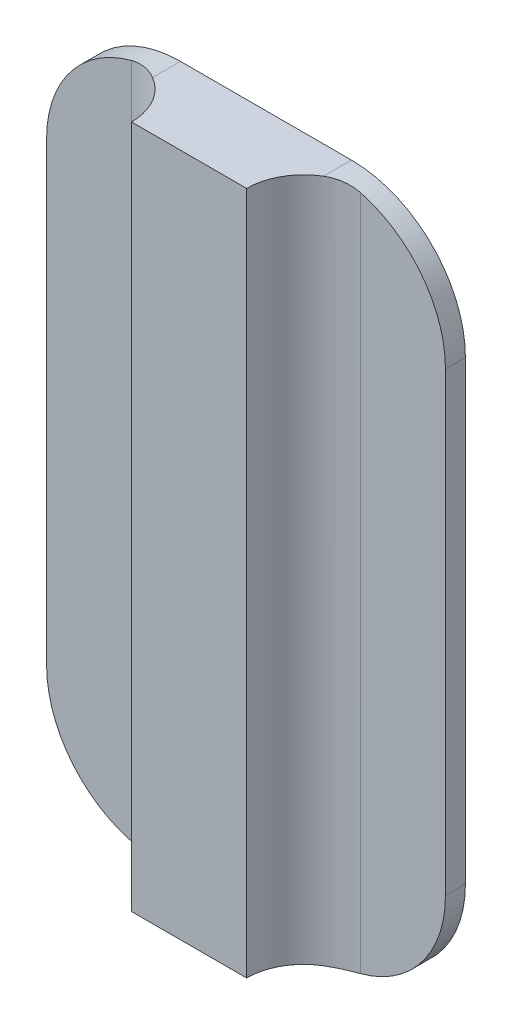
ISO-10303-21;
HEADER;
FILE_DESCRIPTION(('STEP AP214'),'2;1');
FILE_NAME('part.step','',(''),(''),'','','');
FILE_SCHEMA(('AUTOMOTIVE_DESIGN { 1 0 10303 214 1 1 1 1 }'));
ENDSEC;
DATA;
#1=APPLICATION_CONTEXT('core data for automotive mechanical design processes');
#2=APPLICATION_PROTOCOL_DEFINITION('international standard','automotive_design',2000,#1);
#3=PRODUCT_CONTEXT('',#1,'mechanical');
#4=PRODUCT('Part','Part','',(#3));
#5=PRODUCT_RELATED_PRODUCT_CATEGORY('part','',(#4));
#6=PRODUCT_DEFINITION_FORMATION('','',#4);
#7=PRODUCT_DEFINITION_CONTEXT('part definition',#1,'design');
#8=PRODUCT_DEFINITION('design','',#6,#7);
#9=PRODUCT_DEFINITION_SHAPE('','',#8);
#10=(LENGTH_UNIT() NAMED_UNIT(*) SI_UNIT(.MILLI.,.METRE.));
#11=(NAMED_UNIT(*) PLANE_ANGLE_UNIT() SI_UNIT($,.RADIAN.));
#12=(NAMED_UNIT(*) SI_UNIT($,.STERADIAN.) SOLID_ANGLE_UNIT());
#13=UNCERTAINTY_MEASURE_WITH_UNIT(LENGTH_MEASURE(1.E-05),#10,'distance_accuracy_value','');
#14=(GEOMETRIC_REPRESENTATION_CONTEXT(3) GLOBAL_UNCERTAINTY_ASSIGNED_CONTEXT((#13)) GLOBAL_UNIT_ASSIGNED_CONTEXT((#10,
#11,#12)) REPRESENTATION_CONTEXT('',''));
#15=CARTESIAN_POINT('',(0.,0.,0.));
#16=DIRECTION('',(0.,0.,1.));
#17=DIRECTION('',(1.,0.,0.));
#18=AXIS2_PLACEMENT_3D('',#15,#16,#17);
#19=CARTESIAN_POINT('',(0.,0.,3.5));
#20=DIRECTION('',(0.,0.,-1.));
#21=DIRECTION('',(-1.,0.,0.));
#22=AXIS2_PLACEMENT_3D('',#19,#20,#21);
#23=PLANE('',#22);
#24=DIRECTION('',(0.,1.,0.));
#25=VECTOR('',#24,1.);
#26=CARTESIAN_POINT('',(55.1,0.,3.5));
#27=LINE('',#26,#25);
#28=CARTESIAN_POINT('',(55.1,119.33882106024,3.5));
#29=VERTEX_POINT('',#28);
#30=CARTESIAN_POINT('',(55.1,0.661178939759539,3.5));
#31=VERTEX_POINT('',#30);
#32=EDGE_CURVE('E172',#29,#31,#27,.F.);
#33=ORIENTED_EDGE('',*,*,#32,.T.);
#34=CARTESIAN_POINT('',(50.,20.,3.5));
#35=DIRECTION('',(0.,0.,-1.));
#36=DIRECTION('',(-1.,0.,0.));
#37=AXIS2_PLACEMENT_3D('',#34,#35,#36);
#38=CIRCLE('',#37,20.);
#39=CARTESIAN_POINT('',(70.,20.,3.5));
#40=VERTEX_POINT('',#39);
#41=EDGE_CURVE('E253',#31,#40,#38,.F.);
#42=ORIENTED_EDGE('',*,*,#41,.T.);
#43=DIRECTION('',(0.,1.,0.));
#44=VECTOR('',#43,1.);
#45=CARTESIAN_POINT('',(70.,0.,3.5));
#46=LINE('',#45,#44);
#47=CARTESIAN_POINT('',(70.,100.,3.5));
#48=VERTEX_POINT('',#47);
#49=EDGE_CURVE('E157',#40,#48,#46,.T.);
#50=ORIENTED_EDGE('',*,*,#49,.T.);
#51=CARTESIAN_POINT('',(50.,100.,3.5));
#52=DIRECTION('',(0.,0.,-1.));
#53=DIRECTION('',(-1.,0.,0.));
#54=AXIS2_PLACEMENT_3D('',#51,#52,#53);
#55=CIRCLE('',#54,20.);
#56=EDGE_CURVE('E257',#48,#29,#55,.F.);
#57=ORIENTED_EDGE('',*,*,#56,.T.);
#58=EDGE_LOOP('',(#33,#42,#50,#57));
#59=FACE_BOUND('',#58,.T.);
#60=ADVANCED_FACE('F33',(#59),#23,.F.);
#61=DIRECTION('',(0.,-1.,0.));
#62=VECTOR('',#61,1.);
#63=CARTESIAN_POINT('',(0.,0.,3.5));
#64=LINE('',#63,#62);
#65=CARTESIAN_POINT('',(0.,100.,3.5));
#66=VERTEX_POINT('',#65);
#67=CARTESIAN_POINT('',(0.,20.,3.5));
#68=VERTEX_POINT('',#67);
#69=EDGE_CURVE('E154',#66,#68,#64,.T.);
#70=ORIENTED_EDGE('',*,*,#69,.T.);
#71=CARTESIAN_POINT('',(20.,20.,3.5));
#72=DIRECTION('',(0.,0.,-1.));
#73=DIRECTION('',(-1.,0.,0.));
#74=AXIS2_PLACEMENT_3D('',#71,#72,#73);
#75=CIRCLE('',#74,20.);
#76=CARTESIAN_POINT('',(14.9,0.661178939759543,3.5));
#77=VERTEX_POINT('',#76);
#78=EDGE_CURVE('E260',#68,#77,#75,.F.);
#79=ORIENTED_EDGE('',*,*,#78,.T.);
#80=DIRECTION('',(0.,-1.,0.));
#81=VECTOR('',#80,1.);
#82=CARTESIAN_POINT('',(14.9,120.,3.5));
#83=LINE('',#82,#81);
#84=CARTESIAN_POINT('',(14.9,119.33882106024,3.5));
#85=VERTEX_POINT('',#84);
#86=EDGE_CURVE('E161',#77,#85,#83,.F.);
#87=ORIENTED_EDGE('',*,*,#86,.T.);
#88=CARTESIAN_POINT('',(20.,100.,3.5));
#89=DIRECTION('',(0.,0.,-1.));
#90=DIRECTION('',(-1.,0.,0.));
#91=AXIS2_PLACEMENT_3D('',#88,#89,#90);
#92=CIRCLE('',#91,20.);
#93=EDGE_CURVE('E255',#85,#66,#92,.F.);
#94=ORIENTED_EDGE('',*,*,#93,.T.);
#95=EDGE_LOOP('',(#70,#79,#87,#94));
#96=FACE_BOUND('',#95,.T.);
#97=ADVANCED_FACE('F263',(#96),#23,.F.);
#98=CARTESIAN_POINT('',(0.,0.,3.5));
#99=DIRECTION('',(1.,0.,0.));
#100=DIRECTION('',(0.,0.,-1.));
#101=AXIS2_PLACEMENT_3D('',#98,#99,#100);
#102=PLANE('',#101);
#103=DIRECTION('',(0.,-1.,0.));
#104=VECTOR('',#103,1.);
#105=CARTESIAN_POINT('',(0.,0.,0.));
#106=LINE('',#105,#104);
#107=CARTESIAN_POINT('',(0.,100.,0.));
#108=VERTEX_POINT('',#107);
#109=CARTESIAN_POINT('',(0.,20.,0.));
#110=VERTEX_POINT('',#109);
#111=EDGE_CURVE('E153',#108,#110,#106,.T.);
#112=ORIENTED_EDGE('',*,*,#111,.T.);
#113=DIRECTION('',(0.,0.,-1.));
#114=VECTOR('',#113,1.);
#115=CARTESIAN_POINT('',(0.,20.,3.5));
#116=LINE('',#115,#114);
#117=EDGE_CURVE('E252',#110,#68,#116,.F.);
#118=ORIENTED_EDGE('',*,*,#117,.T.);
#119=ORIENTED_EDGE('',*,*,#69,.F.);
#120=DIRECTION('',(0.,0.,-1.));
#121=VECTOR('',#120,1.);
#122=CARTESIAN_POINT('',(0.,100.,3.5));
#123=LINE('',#122,#121);
#124=EDGE_CURVE('E247',#66,#108,#123,.T.);
#125=ORIENTED_EDGE('',*,*,#124,.T.);
#126=EDGE_LOOP('',(#112,#118,#119,#125));
#127=FACE_BOUND('',#126,.T.);
#128=ADVANCED_FACE('F250',(#127),#102,.F.);
#129=CARTESIAN_POINT('',(0.,0.,3.5));
#130=DIRECTION('',(0.,1.,0.));
#131=DIRECTION('',(0.,0.,1.));
#132=AXIS2_PLACEMENT_3D('',#129,#130,#131);
#133=PLANE('',#132);
#134=DIRECTION('',(1.,0.,0.));
#135=VECTOR('',#134,1.);
#136=CARTESIAN_POINT('',(0.,0.,0.));
#137=LINE('',#136,#135);
#138=CARTESIAN_POINT('',(20.,0.,0.));
#139=VERTEX_POINT('',#138);
#140=CARTESIAN_POINT('',(50.,0.,0.));
#141=VERTEX_POINT('',#140);
#142=EDGE_CURVE('E164',#139,#141,#137,.T.);
#143=ORIENTED_EDGE('',*,*,#142,.T.);
#144=DIRECTION('',(0.,0.,-1.));
#145=VECTOR('',#144,1.);
#146=CARTESIAN_POINT('',(50.,0.,3.5));
#147=LINE('',#146,#145);
#148=CARTESIAN_POINT('',(50.,0.,4.89825599078884));
#149=VERTEX_POINT('',#148);
#150=EDGE_CURVE('E196',#141,#149,#147,.F.);
#151=ORIENTED_EDGE('',*,*,#150,.T.);
#152=CARTESIAN_POINT('',(55.1,0.,13.5));
#153=DIRECTION('',(0.,1.,0.));
#154=DIRECTION('',(0.,0.,1.));
#155=AXIS2_PLACEMENT_3D('',#152,#153,#154);
#156=CIRCLE('',#155,10.);
#157=CARTESIAN_POINT('',(45.1,0.,13.5));
#158=VERTEX_POINT('',#157);
#159=EDGE_CURVE('E134',#149,#158,#156,.T.);
#160=ORIENTED_EDGE('',*,*,#159,.T.);
#161=DIRECTION('',(1.,0.,0.));
#162=VECTOR('',#161,1.);
#163=CARTESIAN_POINT('',(24.9,0.,13.5));
#164=LINE('',#163,#162);
#165=CARTESIAN_POINT('',(24.9,0.,13.5));
#166=VERTEX_POINT('',#165);
#167=EDGE_CURVE('E148',#166,#158,#164,.T.);
#168=ORIENTED_EDGE('',*,*,#167,.F.);
#169=CARTESIAN_POINT('',(14.9,0.,13.5));
#170=DIRECTION('',(0.,1.,0.));
#171=DIRECTION('',(0.,0.,1.));
#172=AXIS2_PLACEMENT_3D('',#169,#170,#171);
#173=CIRCLE('',#172,10.);
#174=CARTESIAN_POINT('',(20.,0.,4.89825599078884));
#175=VERTEX_POINT('',#174);
#176=EDGE_CURVE('E175',#166,#175,#173,.T.);
#177=ORIENTED_EDGE('',*,*,#176,.T.);
#178=DIRECTION('',(0.,0.,-1.));
#179=VECTOR('',#178,1.);
#180=CARTESIAN_POINT('',(20.,0.,3.5));
#181=LINE('',#180,#179);
#182=EDGE_CURVE('E193',#175,#139,#181,.T.);
#183=ORIENTED_EDGE('',*,*,#182,.T.);
#184=EDGE_LOOP('',(#143,#151,#160,#168,#177,#183));
#185=FACE_BOUND('',#184,.T.);
#186=ADVANCED_FACE('F268',(#185),#133,.F.);
#187=CARTESIAN_POINT('',(70.,0.,3.5));
#188=DIRECTION('',(-1.,0.,0.));
#189=DIRECTION('',(0.,0.,1.));
#190=AXIS2_PLACEMENT_3D('',#187,#188,#189);
#191=PLANE('',#190);
#192=ORIENTED_EDGE('',*,*,#49,.F.);
#193=DIRECTION('',(0.,0.,-1.));
#194=VECTOR('',#193,1.);
#195=CARTESIAN_POINT('',(70.,20.,3.5));
#196=LINE('',#195,#194);
#197=CARTESIAN_POINT('',(70.,20.,0.));
#198=VERTEX_POINT('',#197);
#199=EDGE_CURVE('E182',#40,#198,#196,.T.);
#200=ORIENTED_EDGE('',*,*,#199,.T.);
#201=DIRECTION('',(0.,1.,0.));
#202=VECTOR('',#201,1.);
#203=CARTESIAN_POINT('',(70.,0.,0.));
#204=LINE('',#203,#202);
#205=CARTESIAN_POINT('',(70.,100.,0.));
#206=VERTEX_POINT('',#205);
#207=EDGE_CURVE('E167',#198,#206,#204,.T.);
#208=ORIENTED_EDGE('',*,*,#207,.T.);
#209=DIRECTION('',(0.,0.,-1.));
#210=VECTOR('',#209,1.);
#211=CARTESIAN_POINT('',(70.,100.,3.5));
#212=LINE('',#211,#210);
#213=EDGE_CURVE('E180',#206,#48,#212,.F.);
#214=ORIENTED_EDGE('',*,*,#213,.T.);
#215=EDGE_LOOP('',(#192,#200,#208,#214));
#216=FACE_BOUND('',#215,.T.);
#217=ADVANCED_FACE('F275',(#216),#191,.F.);
#218=CARTESIAN_POINT('',(0.,120.,3.5));
#219=DIRECTION('',(0.,-1.,0.));
#220=DIRECTION('',(0.,0.,-1.));
#221=AXIS2_PLACEMENT_3D('',#218,#219,#220);
#222=PLANE('',#221);
#223=DIRECTION('',(-1.,0.,0.));
#224=VECTOR('',#223,1.);
#225=CARTESIAN_POINT('',(0.,120.,0.));
#226=LINE('',#225,#224);
#227=CARTESIAN_POINT('',(50.,120.,0.));
#228=VERTEX_POINT('',#227);
#229=CARTESIAN_POINT('',(20.,120.,0.));
#230=VERTEX_POINT('',#229);
#231=EDGE_CURVE('E158',#228,#230,#226,.T.);
#232=ORIENTED_EDGE('',*,*,#231,.T.);
#233=DIRECTION('',(0.,0.,-1.));
#234=VECTOR('',#233,1.);
#235=CARTESIAN_POINT('',(20.,120.,3.5));
#236=LINE('',#235,#234);
#237=CARTESIAN_POINT('',(20.,120.,4.89825599078884));
#238=VERTEX_POINT('',#237);
#239=EDGE_CURVE('E11',#230,#238,#236,.F.);
#240=ORIENTED_EDGE('',*,*,#239,.T.);
#241=CARTESIAN_POINT('',(14.9,120.,13.5));
#242=DIRECTION('',(0.,-1.,0.));
#243=DIRECTION('',(0.,0.,-1.));
#244=AXIS2_PLACEMENT_3D('',#241,#242,#243);
#245=CIRCLE('',#244,10.);
#246=CARTESIAN_POINT('',(24.9,120.,13.5));
#247=VERTEX_POINT('',#246);
#248=EDGE_CURVE('E135',#238,#247,#245,.T.);
#249=ORIENTED_EDGE('',*,*,#248,.T.);
#250=DIRECTION('',(-1.,0.,0.));
#251=VECTOR('',#250,1.);
#252=CARTESIAN_POINT('',(24.9,120.,13.5));
#253=LINE('',#252,#251);
#254=CARTESIAN_POINT('',(45.1,120.,13.5));
#255=VERTEX_POINT('',#254);
#256=EDGE_CURVE('E138',#255,#247,#253,.T.);
#257=ORIENTED_EDGE('',*,*,#256,.F.);
#258=CARTESIAN_POINT('',(55.1,120.,13.5));
#259=DIRECTION('',(0.,-1.,0.));
#260=DIRECTION('',(0.,0.,-1.));
#261=AXIS2_PLACEMENT_3D('',#258,#259,#260);
#262=CIRCLE('',#261,10.);
#263=CARTESIAN_POINT('',(50.,120.,4.89825599078884));
#264=VERTEX_POINT('',#263);
#265=EDGE_CURVE('E123',#255,#264,#262,.T.);
#266=ORIENTED_EDGE('',*,*,#265,.T.);
#267=DIRECTION('',(0.,0.,-1.));
#268=VECTOR('',#267,1.);
#269=CARTESIAN_POINT('',(50.,120.,3.5));
#270=LINE('',#269,#268);
#271=EDGE_CURVE('E42',#264,#228,#270,.T.);
#272=ORIENTED_EDGE('',*,*,#271,.T.);
#273=EDGE_LOOP('',(#232,#240,#249,#257,#266,#272));
#274=FACE_BOUND('',#273,.T.);
#275=ADVANCED_FACE('F139',(#274),#222,.F.);
#276=CARTESIAN_POINT('',(0.,0.,0.));
#277=DIRECTION('',(0.,0.,-1.));
#278=DIRECTION('',(-1.,0.,0.));
#279=AXIS2_PLACEMENT_3D('',#276,#277,#278);
#280=PLANE('',#279);
#281=ORIENTED_EDGE('',*,*,#207,.F.);
#282=CARTESIAN_POINT('',(50.,20.,0.));
#283=DIRECTION('',(0.,0.,-1.));
#284=DIRECTION('',(-1.,0.,0.));
#285=AXIS2_PLACEMENT_3D('',#282,#283,#284);
#286=CIRCLE('',#285,20.);
#287=EDGE_CURVE('E191',#198,#141,#286,.T.);
#288=ORIENTED_EDGE('',*,*,#287,.T.);
#289=ORIENTED_EDGE('',*,*,#142,.F.);
#290=CARTESIAN_POINT('',(20.,20.,0.));
#291=DIRECTION('',(0.,0.,-1.));
#292=DIRECTION('',(-1.,0.,0.));
#293=AXIS2_PLACEMENT_3D('',#290,#291,#292);
#294=CIRCLE('',#293,20.);
#295=EDGE_CURVE('E189',#139,#110,#294,.T.);
#296=ORIENTED_EDGE('',*,*,#295,.T.);
#297=ORIENTED_EDGE('',*,*,#111,.F.);
#298=CARTESIAN_POINT('',(20.,100.,0.));
#299=DIRECTION('',(0.,0.,-1.));
#300=DIRECTION('',(-1.,0.,0.));
#301=AXIS2_PLACEMENT_3D('',#298,#299,#300);
#302=CIRCLE('',#301,20.);
#303=EDGE_CURVE('E187',#108,#230,#302,.T.);
#304=ORIENTED_EDGE('',*,*,#303,.T.);
#305=ORIENTED_EDGE('',*,*,#231,.F.);
#306=CARTESIAN_POINT('',(50.,100.,0.));
#307=DIRECTION('',(0.,0.,-1.));
#308=DIRECTION('',(-1.,0.,0.));
#309=AXIS2_PLACEMENT_3D('',#306,#307,#308);
#310=CIRCLE('',#309,20.);
#311=EDGE_CURVE('E185',#228,#206,#310,.T.);
#312=ORIENTED_EDGE('',*,*,#311,.T.);
#313=EDGE_LOOP('',(#281,#288,#289,#296,#297,#304,#305,#312));
#314=FACE_BOUND('',#313,.T.);
#315=ADVANCED_FACE('F241',(#314),#280,.T.);
#316=CARTESIAN_POINT('',(0.,0.,13.5));
#317=DIRECTION('',(0.,0.,-1.));
#318=DIRECTION('',(-1.,0.,0.));
#319=AXIS2_PLACEMENT_3D('',#316,#317,#318);
#320=PLANE('',#319);
#321=DIRECTION('',(0.,1.,0.));
#322=VECTOR('',#321,1.);
#323=CARTESIAN_POINT('',(45.1,0.,13.5));
#324=LINE('',#323,#322);
#325=EDGE_CURVE('E128',#158,#255,#324,.T.);
#326=ORIENTED_EDGE('',*,*,#325,.T.);
#327=ORIENTED_EDGE('',*,*,#256,.T.);
#328=DIRECTION('',(0.,-1.,0.));
#329=VECTOR('',#328,1.);
#330=CARTESIAN_POINT('',(24.9,0.,13.5));
#331=LINE('',#330,#329);
#332=EDGE_CURVE('E143',#247,#166,#331,.T.);
#333=ORIENTED_EDGE('',*,*,#332,.T.);
#334=ORIENTED_EDGE('',*,*,#167,.T.);
#335=EDGE_LOOP('',(#326,#327,#333,#334));
#336=FACE_BOUND('',#335,.T.);
#337=ADVANCED_FACE('F146',(#336),#320,.F.);
#338=CARTESIAN_POINT('',(14.9,0.,13.5));
#339=DIRECTION('',(0.,1.,0.));
#340=DIRECTION('',(0.,0.,1.));
#341=AXIS2_PLACEMENT_3D('',#338,#339,#340);
#342=CYLINDRICAL_SURFACE('',#341,10.);
#343=ORIENTED_EDGE('',*,*,#86,.F.);
#344=CARTESIAN_POINT('',(14.9,0.661178939759543,3.5));
#345=CARTESIAN_POINT('',(15.0263243389157,0.62786360597415,3.49999971499555));
#346=CARTESIAN_POINT('',(15.1529618876326,0.595792572432518,3.50239425478418));
#347=CARTESIAN_POINT('',(15.4066712976193,0.534174312033795,3.51203701614571));
#348=CARTESIAN_POINT('',(15.533743178789,0.504627202471961,3.51928546315782));
#349=CARTESIAN_POINT('',(15.9153103327047,0.419827743324308,3.54840784025306));
#350=CARTESIAN_POINT('',(16.1701512771768,0.368418801675542,3.57765881230422));
#351=CARTESIAN_POINT('',(16.672393767317,0.277154811077839,3.65512191718378));
#352=CARTESIAN_POINT('',(16.9198247751712,0.237047846191173,3.70285261217251));
#353=CARTESIAN_POINT('',(17.4116304825512,0.166644238382593,3.8172625505769));
#354=CARTESIAN_POINT('',(17.6560061159343,0.136344523790127,3.88393584878333));
#355=CARTESIAN_POINT('',(18.0790044377199,0.0916354563151093,4.01685750809141));
#356=CARTESIAN_POINT('',(18.2587139381788,0.0751462855579517,4.07899970808425));
#357=CARTESIAN_POINT('',(18.6146384910868,0.0472400073845082,4.21357702167284));
#358=CARTESIAN_POINT('',(18.790853705579,0.0358226642403644,4.28601165669132));
#359=CARTESIAN_POINT('',(19.1423219889805,0.0176099328104667,4.44238563764497));
#360=CARTESIAN_POINT('',(19.3174949877549,0.0109052729401183,4.52651532357388));
#361=CARTESIAN_POINT('',(19.6627482453818,0.00209563798823149,4.70488500770233));
#362=CARTESIAN_POINT('',(19.8328282268674,-9.08702750478019E-06,4.79912555526548));
#363=CARTESIAN_POINT('',(20.,0.,4.89825599078884));
#364=B_SPLINE_CURVE_WITH_KNOTS('',3,(#344,#345,#346,#347,#348,#349,#350,#351,#352,#353,#354,
#355,#356,#357,#358,#359,#360,#361,#362,#363),.UNSPECIFIED.,.F.,.F.,(4,2,2,2,2,2,2,2,2,4),(0.,
0.391872308313273,0.783762818357363,1.56756189408804,2.33218358525991,3.09656556156022,
3.66880252934522,4.24101289797859,4.82395819937643,5.40693519058366),.UNSPECIFIED.);
#365=EDGE_CURVE('E228',#77,#175,#364,.T.);
#366=ORIENTED_EDGE('',*,*,#365,.T.);
#367=ORIENTED_EDGE('',*,*,#176,.F.);
#368=ORIENTED_EDGE('',*,*,#332,.F.);
#369=ORIENTED_EDGE('',*,*,#248,.F.);
#370=CARTESIAN_POINT('',(20.,120.,4.89825599078884));
#371=CARTESIAN_POINT('',(19.7752908458507,120.000032485777,4.764976706905));
#372=CARTESIAN_POINT('',(19.5452943068351,119.996214553252,4.64056038807037));
#373=CARTESIAN_POINT('',(19.0764613325542,119.980033924759,4.41016031385645));
#374=CARTESIAN_POINT('',(18.8376224880704,119.967668883543,4.30418162758454));
#375=CARTESIAN_POINT('',(18.3588980899787,119.933966847278,4.11379692819074));
#376=CARTESIAN_POINT('',(18.119181329185,119.912856925975,4.02892627406615));
#377=CARTESIAN_POINT('',(17.6349771478721,119.86116512115,3.8779336788484));
#378=CARTESIAN_POINT('',(17.3904912684179,119.830586251374,3.81180578518069));
#379=CARTESIAN_POINT('',(16.9604539922492,119.768555853484,3.71275060871731));
#380=CARTESIAN_POINT('',(16.7755368816389,119.739255957107,3.67565610368762));
#381=CARTESIAN_POINT('',(16.4048407182431,119.67511642557,3.61208762558375));
#382=CARTESIAN_POINT('',(16.2190617065302,119.640277051804,3.58561315158267));
#383=CARTESIAN_POINT('',(15.8439361205159,119.564365630893,3.54282795920231));
#384=CARTESIAN_POINT('',(15.6545880063808,119.523188912815,3.52671724670253));
#385=CARTESIAN_POINT('',(15.2765801664056,119.435202857162,3.50529691166317));
#386=CARTESIAN_POINT('',(15.0879204721083,119.388393264751,3.49998777799191));
#387=CARTESIAN_POINT('',(14.9,119.33882106024,3.5));
#388=B_SPLINE_CURVE_WITH_KNOTS('',3,(#370,#371,#372,#373,#374,#375,#376,#377,#378,#379,#380,
#381,#382,#383,#384,#385,#386,#387),.UNSPECIFIED.,.F.,.F.,(4,2,2,2,2,2,2,2,4),(0.,
0.783597740519574,1.567410578361,2.33203319718667,3.09641270420965,3.66864597857249,
4.24085225859312,4.82379397265962,5.40676206947923),.UNSPECIFIED.);
#389=EDGE_CURVE('E54',#238,#85,#388,.T.);
#390=ORIENTED_EDGE('',*,*,#389,.T.);
#391=EDGE_LOOP('',(#343,#366,#367,#368,#369,#390));
#392=FACE_BOUND('',#391,.T.);
#393=ADVANCED_FACE('F213',(#392),#342,.F.);
#394=CARTESIAN_POINT('',(55.1,0.,13.5));
#395=DIRECTION('',(0.,-1.,0.));
#396=DIRECTION('',(0.,0.,-1.));
#397=AXIS2_PLACEMENT_3D('',#394,#395,#396);
#398=CYLINDRICAL_SURFACE('',#397,10.);
#399=ORIENTED_EDGE('',*,*,#159,.F.);
#400=CARTESIAN_POINT('',(50.,0.,4.89825599078884));
#401=CARTESIAN_POINT('',(50.2247091541493,-3.24857766658174E-05,4.76497670690501));
#402=CARTESIAN_POINT('',(50.4547056931649,0.00378544674807885,4.64056038807037));
#403=CARTESIAN_POINT('',(50.9235386674458,0.0199660752413991,4.41016031385645));
#404=CARTESIAN_POINT('',(51.1623775119296,0.0323311164570464,4.30418162758454));
#405=CARTESIAN_POINT('',(51.6411019100213,0.0660331527216585,4.11379692819074));
#406=CARTESIAN_POINT('',(51.880818670815,0.0871430740254352,4.02892627406615));
#407=CARTESIAN_POINT('',(52.3650228521279,0.138834878850109,3.8779336788484));
#408=CARTESIAN_POINT('',(52.6095087315821,0.169413748626062,3.81180578518069));
#409=CARTESIAN_POINT('',(53.0395460077508,0.231444146516116,3.71275060871731));
#410=CARTESIAN_POINT('',(53.2244631183611,0.260744042892704,3.67565610368762));
#411=CARTESIAN_POINT('',(53.5951592817569,0.324883574430286,3.61208762558375));
#412=CARTESIAN_POINT('',(53.7809382934698,0.359722948196282,3.58561315158268));
#413=CARTESIAN_POINT('',(54.1560638794842,0.435634369106702,3.54282795920231));
#414=CARTESIAN_POINT('',(54.3454119936192,0.476811087185119,3.52671724670253));
#415=CARTESIAN_POINT('',(54.7234198335944,0.564797142838071,3.50529691166317));
#416=CARTESIAN_POINT('',(54.9120795278917,0.611606735249135,3.4999877779919));
#417=CARTESIAN_POINT('',(55.1,0.661178939759535,3.5));
#418=B_SPLINE_CURVE_WITH_KNOTS('',3,(#400,#401,#402,#403,#404,#405,#406,#407,#408,#409,#410,
#411,#412,#413,#414,#415,#416,#417),.UNSPECIFIED.,.F.,.F.,(4,2,2,2,2,2,2,2,4),(0.,
0.783597740519563,1.567410578361,2.33203319718667,3.09641270420965,3.6686459785725,
4.24085225859313,4.82379397265963,5.40676206947923),.UNSPECIFIED.);
#419=EDGE_CURVE('E203',#149,#31,#418,.T.);
#420=ORIENTED_EDGE('',*,*,#419,.T.);
#421=ORIENTED_EDGE('',*,*,#32,.F.);
#422=CARTESIAN_POINT('',(55.1,119.33882106024,3.5));
#423=CARTESIAN_POINT('',(54.9736756610843,119.372136394026,3.49999971499555));
#424=CARTESIAN_POINT('',(54.8470381123674,119.404207427567,3.50239425478418));
#425=CARTESIAN_POINT('',(54.5933287023807,119.465825687966,3.51203701614571));
#426=CARTESIAN_POINT('',(54.466256821211,119.495372797528,3.51928546315782));
#427=CARTESIAN_POINT('',(54.0846896672953,119.580172256676,3.54840784025306));
#428=CARTESIAN_POINT('',(53.8298487228232,119.631581198324,3.57765881230422));
#429=CARTESIAN_POINT('',(53.327606232683,119.722845188922,3.65512191718378));
#430=CARTESIAN_POINT('',(53.0801752248288,119.762952153809,3.70285261217252));
#431=CARTESIAN_POINT('',(52.5883695174488,119.833355761617,3.81726255057691));
#432=CARTESIAN_POINT('',(52.3439938840657,119.86365547621,3.88393584878333));
#433=CARTESIAN_POINT('',(51.9209955622802,119.908364543685,4.01685750809141));
#434=CARTESIAN_POINT('',(51.7412860618212,119.924853714442,4.07899970808425));
#435=CARTESIAN_POINT('',(51.3853615089133,119.952759992615,4.21357702167283));
#436=CARTESIAN_POINT('',(51.209146294421,119.96417733576,4.28601165669132));
#437=CARTESIAN_POINT('',(50.8576780110195,119.98239006719,4.44238563764497));
#438=CARTESIAN_POINT('',(50.6825050122451,119.98909472706,4.52651532357388));
#439=CARTESIAN_POINT('',(50.3372517546182,119.997904362012,4.70488500770232));
#440=CARTESIAN_POINT('',(50.1671717731326,120.000009087027,4.79912555526548));
#441=CARTESIAN_POINT('',(50.,120.,4.89825599078884));
#442=B_SPLINE_CURVE_WITH_KNOTS('',3,(#422,#423,#424,#425,#426,#427,#428,#429,#430,#431,#432,
#433,#434,#435,#436,#437,#438,#439,#440,#441),.UNSPECIFIED.,.F.,.F.,(4,2,2,2,2,2,2,2,2,4),(0.,
0.391872308313277,0.783762818357355,1.56756189408803,2.33218358525992,3.09656556156022,
3.66880252934521,4.24101289797858,4.82395819937643,5.40693519058367),.UNSPECIFIED.);
#443=EDGE_CURVE('E131',#29,#264,#442,.T.);
#444=ORIENTED_EDGE('',*,*,#443,.T.);
#445=ORIENTED_EDGE('',*,*,#265,.F.);
#446=ORIENTED_EDGE('',*,*,#325,.F.);
#447=EDGE_LOOP('',(#399,#420,#421,#444,#445,#446));
#448=FACE_BOUND('',#447,.T.);
#449=ADVANCED_FACE('F126',(#448),#398,.F.);
#450=CARTESIAN_POINT('',(50.,20.,3.5));
#451=DIRECTION('',(0.,0.,-1.));
#452=DIRECTION('',(-1.,0.,0.));
#453=AXIS2_PLACEMENT_3D('',#450,#451,#452);
#454=CYLINDRICAL_SURFACE('',#453,20.);
#455=ORIENTED_EDGE('',*,*,#419,.F.);
#456=ORIENTED_EDGE('',*,*,#150,.F.);
#457=ORIENTED_EDGE('',*,*,#287,.F.);
#458=ORIENTED_EDGE('',*,*,#199,.F.);
#459=ORIENTED_EDGE('',*,*,#41,.F.);
#460=EDGE_LOOP('',(#455,#456,#457,#458,#459));
#461=FACE_BOUND('',#460,.T.);
#462=ADVANCED_FACE('F212',(#461),#454,.T.);
#463=CARTESIAN_POINT('',(20.,20.,3.5));
#464=DIRECTION('',(0.,0.,-1.));
#465=DIRECTION('',(-1.,0.,0.));
#466=AXIS2_PLACEMENT_3D('',#463,#464,#465);
#467=CYLINDRICAL_SURFACE('',#466,20.);
#468=ORIENTED_EDGE('',*,*,#78,.F.);
#469=ORIENTED_EDGE('',*,*,#117,.F.);
#470=ORIENTED_EDGE('',*,*,#295,.F.);
#471=ORIENTED_EDGE('',*,*,#182,.F.);
#472=ORIENTED_EDGE('',*,*,#365,.F.);
#473=EDGE_LOOP('',(#468,#469,#470,#471,#472));
#474=FACE_BOUND('',#473,.T.);
#475=ADVANCED_FACE('F220',(#474),#467,.T.);
#476=CARTESIAN_POINT('',(20.,100.,3.5));
#477=DIRECTION('',(0.,0.,-1.));
#478=DIRECTION('',(-1.,0.,0.));
#479=AXIS2_PLACEMENT_3D('',#476,#477,#478);
#480=CYLINDRICAL_SURFACE('',#479,20.);
#481=ORIENTED_EDGE('',*,*,#389,.F.);
#482=ORIENTED_EDGE('',*,*,#239,.F.);
#483=ORIENTED_EDGE('',*,*,#303,.F.);
#484=ORIENTED_EDGE('',*,*,#124,.F.);
#485=ORIENTED_EDGE('',*,*,#93,.F.);
#486=EDGE_LOOP('',(#481,#482,#483,#484,#485));
#487=FACE_BOUND('',#486,.T.);
#488=ADVANCED_FACE('F224',(#487),#480,.T.);
#489=CARTESIAN_POINT('',(50.,100.,3.5));
#490=DIRECTION('',(0.,0.,-1.));
#491=DIRECTION('',(-1.,0.,0.));
#492=AXIS2_PLACEMENT_3D('',#489,#490,#491);
#493=CYLINDRICAL_SURFACE('',#492,20.);
#494=ORIENTED_EDGE('',*,*,#56,.F.);
#495=ORIENTED_EDGE('',*,*,#213,.F.);
#496=ORIENTED_EDGE('',*,*,#311,.F.);
#497=ORIENTED_EDGE('',*,*,#271,.F.);
#498=ORIENTED_EDGE('',*,*,#443,.F.);
#499=EDGE_LOOP('',(#494,#495,#496,#497,#498));
#500=FACE_BOUND('',#499,.T.);
#501=ADVANCED_FACE('F35',(#500),#493,.T.);
#502=CLOSED_SHELL('',(#60,#97,#128,#186,#217,#275,#315,#337,#393,#449,#462,#475,#488,#501));
#503=MANIFOLD_SOLID_BREP('B2',#502);
#504=ADVANCED_BREP_SHAPE_REPRESENTATION('',(#18,#503),#14);
#505=SHAPE_DEFINITION_REPRESENTATION(#9,#504);
ENDSEC;
END-ISO-10303-21;
